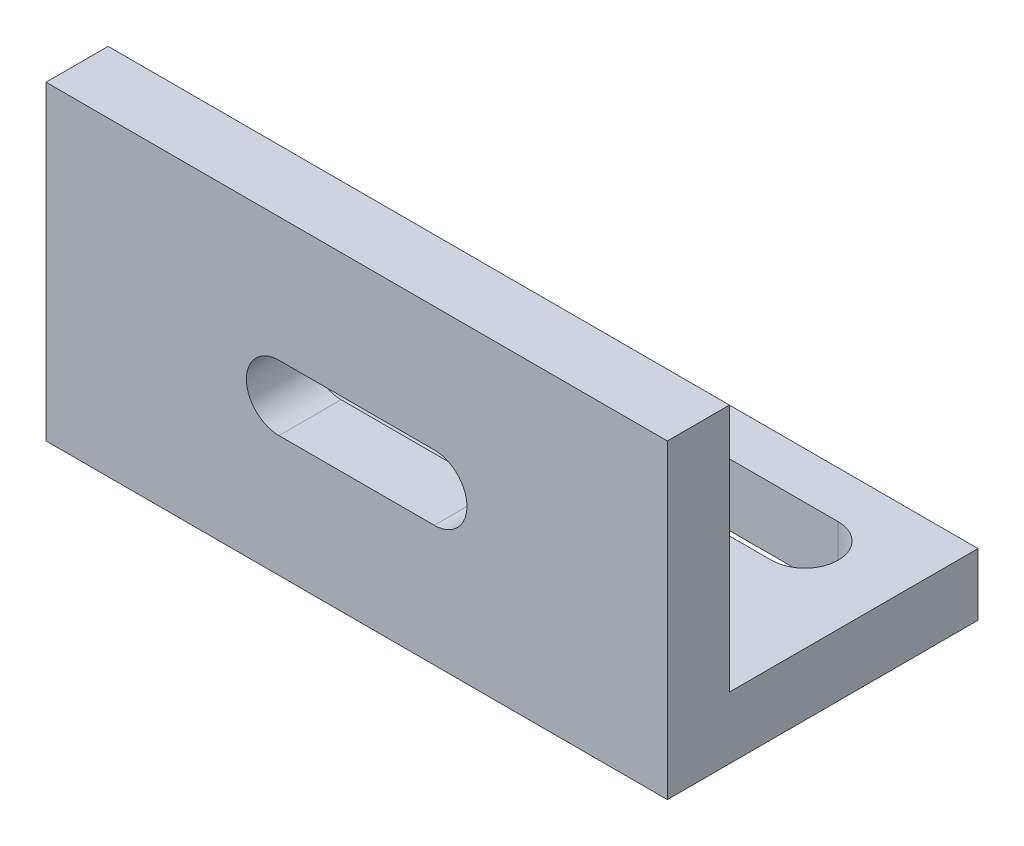
ISO-10303-21;
HEADER;
FILE_DESCRIPTION(('STEP AP214'),'2;1');
FILE_NAME('part.step','',(''),(''),'','','');
FILE_SCHEMA(('AUTOMOTIVE_DESIGN { 1 0 10303 214 1 1 1 1 }'));
ENDSEC;
DATA;
#1=APPLICATION_CONTEXT('core data for automotive mechanical design processes');
#2=APPLICATION_PROTOCOL_DEFINITION('international standard','automotive_design',2000,#1);
#3=PRODUCT_CONTEXT('',#1,'mechanical');
#4=PRODUCT('Part','Part','',(#3));
#5=PRODUCT_RELATED_PRODUCT_CATEGORY('part','',(#4));
#6=PRODUCT_DEFINITION_FORMATION('','',#4);
#7=PRODUCT_DEFINITION_CONTEXT('part definition',#1,'design');
#8=PRODUCT_DEFINITION('design','',#6,#7);
#9=PRODUCT_DEFINITION_SHAPE('','',#8);
#10=(LENGTH_UNIT() NAMED_UNIT(*) SI_UNIT(.MILLI.,.METRE.));
#11=(NAMED_UNIT(*) PLANE_ANGLE_UNIT() SI_UNIT($,.RADIAN.));
#12=(NAMED_UNIT(*) SI_UNIT($,.STERADIAN.) SOLID_ANGLE_UNIT());
#13=UNCERTAINTY_MEASURE_WITH_UNIT(LENGTH_MEASURE(1.E-05),#10,'distance_accuracy_value','');
#14=(GEOMETRIC_REPRESENTATION_CONTEXT(3) GLOBAL_UNCERTAINTY_ASSIGNED_CONTEXT((#13)) GLOBAL_UNIT_ASSIGNED_CONTEXT((#10,
#11,#12)) REPRESENTATION_CONTEXT('',''));
#15=CARTESIAN_POINT('',(0.,0.,0.));
#16=DIRECTION('',(0.,0.,1.));
#17=DIRECTION('',(1.,0.,0.));
#18=AXIS2_PLACEMENT_3D('',#15,#16,#17);
#19=CARTESIAN_POINT('',(-49.2592592592593,4.,0.));
#20=DIRECTION('',(1.,0.,0.));
#21=DIRECTION('',(0.,0.,-1.));
#22=AXIS2_PLACEMENT_3D('',#19,#20,#21);
#23=PLANE('',#22);
#24=DIRECTION('',(0.,0.,1.));
#25=VECTOR('',#24,1.);
#26=CARTESIAN_POINT('',(-49.2592592592593,0.,0.));
#27=LINE('',#26,#25);
#28=CARTESIAN_POINT('',(-49.2592592592593,0.,-12.8888888888889));
#29=VERTEX_POINT('',#28);
#30=CARTESIAN_POINT('',(-49.2592592592593,0.,7.1111111111111));
#31=VERTEX_POINT('',#30);
#32=EDGE_CURVE('E211',#29,#31,#27,.T.);
#33=ORIENTED_EDGE('',*,*,#32,.T.);
#34=DIRECTION('',(0.,-1.,0.));
#35=VECTOR('',#34,1.);
#36=CARTESIAN_POINT('',(-49.2592592592593,4.,7.1111111111111));
#37=LINE('',#36,#35);
#38=CARTESIAN_POINT('',(-49.2592592592593,20.,7.1111111111111));
#39=VERTEX_POINT('',#38);
#40=EDGE_CURVE('E237',#39,#31,#37,.T.);
#41=ORIENTED_EDGE('',*,*,#40,.F.);
#42=DIRECTION('',(0.,0.,1.));
#43=VECTOR('',#42,1.);
#44=CARTESIAN_POINT('',(-49.2592592592593,20.,7.1111111111111));
#45=LINE('',#44,#43);
#46=CARTESIAN_POINT('',(-49.2592592592593,20.,3.1111111111111));
#47=VERTEX_POINT('',#46);
#48=EDGE_CURVE('E193',#47,#39,#45,.T.);
#49=ORIENTED_EDGE('',*,*,#48,.F.);
#50=DIRECTION('',(0.,-1.,0.));
#51=VECTOR('',#50,1.);
#52=CARTESIAN_POINT('',(-49.2592592592593,20.,3.1111111111111));
#53=LINE('',#52,#51);
#54=CARTESIAN_POINT('',(-49.2592592592593,4.,3.1111111111111));
#55=VERTEX_POINT('',#54);
#56=EDGE_CURVE('E203',#47,#55,#53,.T.);
#57=ORIENTED_EDGE('',*,*,#56,.T.);
#58=DIRECTION('',(0.,0.,1.));
#59=VECTOR('',#58,1.);
#60=CARTESIAN_POINT('',(-49.2592592592593,4.,0.));
#61=LINE('',#60,#59);
#62=CARTESIAN_POINT('',(-49.2592592592593,4.,-12.8888888888889));
#63=VERTEX_POINT('',#62);
#64=EDGE_CURVE('E212',#63,#55,#61,.T.);
#65=ORIENTED_EDGE('',*,*,#64,.F.);
#66=DIRECTION('',(0.,-1.,0.));
#67=VECTOR('',#66,1.);
#68=CARTESIAN_POINT('',(-49.2592592592593,4.,-12.8888888888889));
#69=LINE('',#68,#67);
#70=EDGE_CURVE('E221',#63,#29,#69,.T.);
#71=ORIENTED_EDGE('',*,*,#70,.T.);
#72=EDGE_LOOP('',(#33,#41,#49,#57,#65,#71));
#73=FACE_BOUND('',#72,.T.);
#74=ADVANCED_FACE('F35',(#73),#23,.F.);
#75=CARTESIAN_POINT('',(0.,4.,7.1111111111111));
#76=DIRECTION('',(0.,0.,-1.));
#77=DIRECTION('',(-1.,0.,0.));
#78=AXIS2_PLACEMENT_3D('',#75,#76,#77);
#79=PLANE('',#78);
#80=DIRECTION('',(1.,0.,0.));
#81=VECTOR('',#80,1.);
#82=CARTESIAN_POINT('',(0.,11.9972184246575,7.1111111111111));
#83=LINE('',#82,#81);
#84=CARTESIAN_POINT('',(-34.2592592592593,11.9972184246575,7.1111111111111));
#85=VERTEX_POINT('',#84);
#86=CARTESIAN_POINT('',(-24.2592592592593,11.9972184246575,7.1111111111111));
#87=VERTEX_POINT('',#86);
#88=EDGE_CURVE('E166',#85,#87,#83,.T.);
#89=ORIENTED_EDGE('',*,*,#88,.T.);
#90=CARTESIAN_POINT('',(-24.2592592592593,9.89721842465749,7.1111111111111));
#91=DIRECTION('',(0.,0.,-1.));
#92=DIRECTION('',(-1.,0.,0.));
#93=AXIS2_PLACEMENT_3D('',#90,#91,#92);
#94=CIRCLE('',#93,2.1);
#95=CARTESIAN_POINT('',(-24.2592592592593,7.79721842465749,7.1111111111111));
#96=VERTEX_POINT('',#95);
#97=EDGE_CURVE('E169',#87,#96,#94,.T.);
#98=ORIENTED_EDGE('',*,*,#97,.T.);
#99=DIRECTION('',(-1.,0.,0.));
#100=VECTOR('',#99,1.);
#101=CARTESIAN_POINT('',(0.,7.79721842465749,7.1111111111111));
#102=LINE('',#101,#100);
#103=CARTESIAN_POINT('',(-34.2592592592593,7.79721842465749,7.1111111111111));
#104=VERTEX_POINT('',#103);
#105=EDGE_CURVE('E161',#96,#104,#102,.T.);
#106=ORIENTED_EDGE('',*,*,#105,.T.);
#107=CARTESIAN_POINT('',(-34.2592592592593,9.89721842465749,7.1111111111111));
#108=DIRECTION('',(0.,0.,-1.));
#109=DIRECTION('',(-1.,0.,0.));
#110=AXIS2_PLACEMENT_3D('',#107,#108,#109);
#111=CIRCLE('',#110,2.1);
#112=EDGE_CURVE('E141',#104,#85,#111,.T.);
#113=ORIENTED_EDGE('',*,*,#112,.T.);
#114=EDGE_LOOP('',(#89,#98,#106,#113));
#115=FACE_BOUND('',#114,.T.);
#116=DIRECTION('',(1.,0.,0.));
#117=VECTOR('',#116,1.);
#118=CARTESIAN_POINT('',(0.,0.,7.1111111111111));
#119=LINE('',#118,#117);
#120=CARTESIAN_POINT('',(-9.25925925925926,0.,7.1111111111111));
#121=VERTEX_POINT('',#120);
#122=EDGE_CURVE('E224',#31,#121,#119,.T.);
#123=ORIENTED_EDGE('',*,*,#122,.T.);
#124=DIRECTION('',(0.,-1.,0.));
#125=VECTOR('',#124,1.);
#126=CARTESIAN_POINT('',(-9.25925925925926,4.,7.1111111111111));
#127=LINE('',#126,#125);
#128=CARTESIAN_POINT('',(-9.25925925925926,20.,7.1111111111111));
#129=VERTEX_POINT('',#128);
#130=EDGE_CURVE('E235',#129,#121,#127,.T.);
#131=ORIENTED_EDGE('',*,*,#130,.F.);
#132=DIRECTION('',(1.,0.,0.));
#133=VECTOR('',#132,1.);
#134=CARTESIAN_POINT('',(-49.2592592592593,20.,7.1111111111111));
#135=LINE('',#134,#133);
#136=EDGE_CURVE('E196',#39,#129,#135,.T.);
#137=ORIENTED_EDGE('',*,*,#136,.F.);
#138=ORIENTED_EDGE('',*,*,#40,.T.);
#139=EDGE_LOOP('',(#123,#131,#137,#138));
#140=FACE_BOUND('',#139,.T.);
#141=ADVANCED_FACE('F280',(#115,#140),#79,.F.);
#142=CARTESIAN_POINT('',(-9.25925925925926,4.,0.));
#143=DIRECTION('',(1.,0.,0.));
#144=DIRECTION('',(0.,0.,-1.));
#145=AXIS2_PLACEMENT_3D('',#142,#143,#144);
#146=PLANE('',#145);
#147=DIRECTION('',(0.,0.,1.));
#148=VECTOR('',#147,1.);
#149=CARTESIAN_POINT('',(-9.25925925925926,0.,0.));
#150=LINE('',#149,#148);
#151=CARTESIAN_POINT('',(-9.25925925925926,0.,-12.8888888888889));
#152=VERTEX_POINT('',#151);
#153=EDGE_CURVE('E227',#152,#121,#150,.T.);
#154=ORIENTED_EDGE('',*,*,#153,.F.);
#155=DIRECTION('',(0.,-1.,0.));
#156=VECTOR('',#155,1.);
#157=CARTESIAN_POINT('',(-9.25925925925926,4.,-12.8888888888889));
#158=LINE('',#157,#156);
#159=CARTESIAN_POINT('',(-9.25925925925926,4.,-12.8888888888889));
#160=VERTEX_POINT('',#159);
#161=EDGE_CURVE('E233',#160,#152,#158,.T.);
#162=ORIENTED_EDGE('',*,*,#161,.F.);
#163=DIRECTION('',(0.,0.,1.));
#164=VECTOR('',#163,1.);
#165=CARTESIAN_POINT('',(-9.25925925925926,4.,0.));
#166=LINE('',#165,#164);
#167=CARTESIAN_POINT('',(-9.25925925925926,4.,3.1111111111111));
#168=VERTEX_POINT('',#167);
#169=EDGE_CURVE('E214',#160,#168,#166,.T.);
#170=ORIENTED_EDGE('',*,*,#169,.T.);
#171=DIRECTION('',(0.,-1.,0.));
#172=VECTOR('',#171,1.);
#173=CARTESIAN_POINT('',(-9.25925925925926,20.,3.1111111111111));
#174=LINE('',#173,#172);
#175=CARTESIAN_POINT('',(-9.25925925925926,20.,3.1111111111111));
#176=VERTEX_POINT('',#175);
#177=EDGE_CURVE('E208',#176,#168,#174,.T.);
#178=ORIENTED_EDGE('',*,*,#177,.F.);
#179=DIRECTION('',(0.,0.,-1.));
#180=VECTOR('',#179,1.);
#181=CARTESIAN_POINT('',(-9.25925925925926,20.,7.1111111111111));
#182=LINE('',#181,#180);
#183=EDGE_CURVE('E199',#129,#176,#182,.T.);
#184=ORIENTED_EDGE('',*,*,#183,.F.);
#185=ORIENTED_EDGE('',*,*,#130,.T.);
#186=EDGE_LOOP('',(#154,#162,#170,#178,#184,#185));
#187=FACE_BOUND('',#186,.T.);
#188=ADVANCED_FACE('F285',(#187),#146,.T.);
#189=CARTESIAN_POINT('',(0.,4.,-12.8888888888889));
#190=DIRECTION('',(0.,0.,-1.));
#191=DIRECTION('',(-1.,0.,0.));
#192=AXIS2_PLACEMENT_3D('',#189,#190,#191);
#193=PLANE('',#192);
#194=DIRECTION('',(1.,0.,0.));
#195=VECTOR('',#194,1.);
#196=CARTESIAN_POINT('',(0.,0.,-12.8888888888889));
#197=LINE('',#196,#195);
#198=EDGE_CURVE('E215',#29,#152,#197,.T.);
#199=ORIENTED_EDGE('',*,*,#198,.F.);
#200=ORIENTED_EDGE('',*,*,#70,.F.);
#201=DIRECTION('',(1.,0.,0.));
#202=VECTOR('',#201,1.);
#203=CARTESIAN_POINT('',(0.,4.,-12.8888888888889));
#204=LINE('',#203,#202);
#205=EDGE_CURVE('E218',#63,#160,#204,.T.);
#206=ORIENTED_EDGE('',*,*,#205,.T.);
#207=ORIENTED_EDGE('',*,*,#161,.T.);
#208=EDGE_LOOP('',(#199,#200,#206,#207));
#209=FACE_BOUND('',#208,.T.);
#210=ADVANCED_FACE('F293',(#209),#193,.T.);
#211=CARTESIAN_POINT('',(0.,4.,0.));
#212=DIRECTION('',(0.,1.,0.));
#213=DIRECTION('',(0.,0.,1.));
#214=AXIS2_PLACEMENT_3D('',#211,#212,#213);
#215=PLANE('',#214);
#216=CARTESIAN_POINT('',(-15.2592592592593,4.,-7.73888888888891));
#217=DIRECTION('',(0.,1.,0.));
#218=DIRECTION('',(0.,0.,1.));
#219=AXIS2_PLACEMENT_3D('',#216,#217,#218);
#220=CIRCLE('',#219,2.15);
#221=CARTESIAN_POINT('',(-15.2592592592593,4.,-5.58888888888891));
#222=VERTEX_POINT('',#221);
#223=CARTESIAN_POINT('',(-15.2592592592593,4.,-9.8888888888889));
#224=VERTEX_POINT('',#223);
#225=EDGE_CURVE('E172',#222,#224,#220,.T.);
#226=ORIENTED_EDGE('',*,*,#225,.F.);
#227=DIRECTION('',(1.,0.,0.));
#228=VECTOR('',#227,1.);
#229=CARTESIAN_POINT('',(-15.2592592592593,4.,-5.58888888888891));
#230=LINE('',#229,#228);
#231=CARTESIAN_POINT('',(-43.2592592592593,4.,-5.58888888888891));
#232=VERTEX_POINT('',#231);
#233=EDGE_CURVE('E180',#232,#222,#230,.T.);
#234=ORIENTED_EDGE('',*,*,#233,.F.);
#235=CARTESIAN_POINT('',(-43.2592592592593,4.,-7.73888888888891));
#236=DIRECTION('',(0.,1.,0.));
#237=DIRECTION('',(0.,0.,1.));
#238=AXIS2_PLACEMENT_3D('',#235,#236,#237);
#239=CIRCLE('',#238,2.14999999999999);
#240=CARTESIAN_POINT('',(-43.2592592592593,4.,-9.8888888888889));
#241=VERTEX_POINT('',#240);
#242=EDGE_CURVE('E177',#241,#232,#239,.T.);
#243=ORIENTED_EDGE('',*,*,#242,.F.);
#244=DIRECTION('',(-1.,0.,0.));
#245=VECTOR('',#244,1.);
#246=CARTESIAN_POINT('',(-15.2592592592593,4.,-9.8888888888889));
#247=LINE('',#246,#245);
#248=EDGE_CURVE('E174',#224,#241,#247,.T.);
#249=ORIENTED_EDGE('',*,*,#248,.F.);
#250=EDGE_LOOP('',(#226,#234,#243,#249));
#251=FACE_BOUND('',#250,.T.);
#252=DIRECTION('',(-1.,0.,0.));
#253=VECTOR('',#252,1.);
#254=CARTESIAN_POINT('',(-49.2592592592593,4.,3.1111111111111));
#255=LINE('',#254,#253);
#256=EDGE_CURVE('E186',#168,#55,#255,.T.);
#257=ORIENTED_EDGE('',*,*,#256,.F.);
#258=ORIENTED_EDGE('',*,*,#169,.F.);
#259=ORIENTED_EDGE('',*,*,#205,.F.);
#260=ORIENTED_EDGE('',*,*,#64,.T.);
#261=EDGE_LOOP('',(#257,#258,#259,#260));
#262=FACE_BOUND('',#261,.T.);
#263=ADVANCED_FACE('F261',(#251,#262),#215,.T.);
#264=CARTESIAN_POINT('',(0.,0.,0.));
#265=DIRECTION('',(0.,1.,0.));
#266=DIRECTION('',(0.,0.,1.));
#267=AXIS2_PLACEMENT_3D('',#264,#265,#266);
#268=PLANE('',#267);
#269=DIRECTION('',(1.,0.,0.));
#270=VECTOR('',#269,1.);
#271=CARTESIAN_POINT('',(0.,0.,-5.58888888888891));
#272=LINE('',#271,#270);
#273=CARTESIAN_POINT('',(-43.2592592592593,0.,-5.58888888888891));
#274=VERTEX_POINT('',#273);
#275=CARTESIAN_POINT('',(-15.2592592592593,0.,-5.58888888888891));
#276=VERTEX_POINT('',#275);
#277=EDGE_CURVE('E42',#274,#276,#272,.T.);
#278=ORIENTED_EDGE('',*,*,#277,.T.);
#279=CARTESIAN_POINT('',(-15.2592592592593,0.,-7.73888888888891));
#280=DIRECTION('',(0.,1.,0.));
#281=DIRECTION('',(0.,0.,1.));
#282=AXIS2_PLACEMENT_3D('',#279,#280,#281);
#283=CIRCLE('',#282,2.15);
#284=CARTESIAN_POINT('',(-15.2592592592593,0.,-9.8888888888889));
#285=VERTEX_POINT('',#284);
#286=EDGE_CURVE('E11',#276,#285,#283,.T.);
#287=ORIENTED_EDGE('',*,*,#286,.T.);
#288=DIRECTION('',(-1.,0.,0.));
#289=VECTOR('',#288,1.);
#290=CARTESIAN_POINT('',(0.,0.,-9.88888888888891));
#291=LINE('',#290,#289);
#292=CARTESIAN_POINT('',(-43.2592592592593,0.,-9.8888888888889));
#293=VERTEX_POINT('',#292);
#294=EDGE_CURVE('E240',#285,#293,#291,.T.);
#295=ORIENTED_EDGE('',*,*,#294,.T.);
#296=CARTESIAN_POINT('',(-43.2592592592593,0.,-7.73888888888891));
#297=DIRECTION('',(0.,1.,0.));
#298=DIRECTION('',(0.,0.,1.));
#299=AXIS2_PLACEMENT_3D('',#296,#297,#298);
#300=CIRCLE('',#299,2.14999999999999);
#301=EDGE_CURVE('E243',#293,#274,#300,.T.);
#302=ORIENTED_EDGE('',*,*,#301,.T.);
#303=EDGE_LOOP('',(#278,#287,#295,#302));
#304=FACE_BOUND('',#303,.T.);
#305=ORIENTED_EDGE('',*,*,#32,.F.);
#306=ORIENTED_EDGE('',*,*,#198,.T.);
#307=ORIENTED_EDGE('',*,*,#153,.T.);
#308=ORIENTED_EDGE('',*,*,#122,.F.);
#309=EDGE_LOOP('',(#305,#306,#307,#308));
#310=FACE_BOUND('',#309,.T.);
#311=ADVANCED_FACE('F247',(#304,#310),#268,.F.);
#312=CARTESIAN_POINT('',(-49.2592592592593,20.,3.1111111111111));
#313=DIRECTION('',(0.,0.,1.));
#314=DIRECTION('',(1.,0.,0.));
#315=AXIS2_PLACEMENT_3D('',#312,#313,#314);
#316=PLANE('',#315);
#317=DIRECTION('',(-1.,0.,0.));
#318=VECTOR('',#317,1.);
#319=CARTESIAN_POINT('',(-24.2592592592593,7.79721842465749,3.1111111111111));
#320=LINE('',#319,#318);
#321=CARTESIAN_POINT('',(-24.2592592592593,7.79721842465749,3.1111111111111));
#322=VERTEX_POINT('',#321);
#323=CARTESIAN_POINT('',(-34.2592592592593,7.79721842465749,3.1111111111111));
#324=VERTEX_POINT('',#323);
#325=EDGE_CURVE('E147',#322,#324,#320,.T.);
#326=ORIENTED_EDGE('',*,*,#325,.F.);
#327=CARTESIAN_POINT('',(-24.2592592592593,9.89721842465749,3.1111111111111));
#328=DIRECTION('',(0.,0.,-1.));
#329=DIRECTION('',(-1.,0.,0.));
#330=AXIS2_PLACEMENT_3D('',#327,#328,#329);
#331=CIRCLE('',#330,2.1);
#332=CARTESIAN_POINT('',(-24.2592592592593,11.9972184246575,3.1111111111111));
#333=VERTEX_POINT('',#332);
#334=EDGE_CURVE('E57',#333,#322,#331,.T.);
#335=ORIENTED_EDGE('',*,*,#334,.F.);
#336=DIRECTION('',(1.,0.,0.));
#337=VECTOR('',#336,1.);
#338=CARTESIAN_POINT('',(-24.2592592592593,11.9972184246575,3.1111111111111));
#339=LINE('',#338,#337);
#340=CARTESIAN_POINT('',(-34.2592592592593,11.9972184246575,3.1111111111111));
#341=VERTEX_POINT('',#340);
#342=EDGE_CURVE('E154',#341,#333,#339,.T.);
#343=ORIENTED_EDGE('',*,*,#342,.F.);
#344=CARTESIAN_POINT('',(-34.2592592592593,9.89721842465749,3.1111111111111));
#345=DIRECTION('',(0.,0.,-1.));
#346=DIRECTION('',(-1.,0.,0.));
#347=AXIS2_PLACEMENT_3D('',#344,#345,#346);
#348=CIRCLE('',#347,2.1);
#349=EDGE_CURVE('E138',#324,#341,#348,.T.);
#350=ORIENTED_EDGE('',*,*,#349,.F.);
#351=EDGE_LOOP('',(#326,#335,#343,#350));
#352=FACE_BOUND('',#351,.T.);
#353=ORIENTED_EDGE('',*,*,#256,.T.);
#354=ORIENTED_EDGE('',*,*,#56,.F.);
#355=DIRECTION('',(-1.,0.,0.));
#356=VECTOR('',#355,1.);
#357=CARTESIAN_POINT('',(-49.2592592592593,20.,3.1111111111111));
#358=LINE('',#357,#356);
#359=EDGE_CURVE('E201',#176,#47,#358,.T.);
#360=ORIENTED_EDGE('',*,*,#359,.F.);
#361=ORIENTED_EDGE('',*,*,#177,.T.);
#362=EDGE_LOOP('',(#353,#354,#360,#361));
#363=FACE_BOUND('',#362,.T.);
#364=ADVANCED_FACE('F151',(#352,#363),#316,.F.);
#365=CARTESIAN_POINT('',(0.,20.,0.));
#366=DIRECTION('',(0.,-1.,0.));
#367=DIRECTION('',(0.,0.,-1.));
#368=AXIS2_PLACEMENT_3D('',#365,#366,#367);
#369=PLANE('',#368);
#370=ORIENTED_EDGE('',*,*,#48,.T.);
#371=ORIENTED_EDGE('',*,*,#136,.T.);
#372=ORIENTED_EDGE('',*,*,#183,.T.);
#373=ORIENTED_EDGE('',*,*,#359,.T.);
#374=EDGE_LOOP('',(#370,#371,#372,#373));
#375=FACE_BOUND('',#374,.T.);
#376=ADVANCED_FACE('F302',(#375),#369,.F.);
#377=CARTESIAN_POINT('',(-15.2592592592593,-6.,-7.73888888888891));
#378=DIRECTION('',(0.,1.,0.));
#379=DIRECTION('',(0.,0.,1.));
#380=AXIS2_PLACEMENT_3D('',#377,#378,#379);
#381=CYLINDRICAL_SURFACE('',#380,2.15);
#382=DIRECTION('',(0.,1.,0.));
#383=VECTOR('',#382,1.);
#384=CARTESIAN_POINT('',(-15.2592592592593,-6.,-5.58888888888891));
#385=LINE('',#384,#383);
#386=EDGE_CURVE('E184',#276,#222,#385,.T.);
#387=ORIENTED_EDGE('',*,*,#386,.T.);
#388=ORIENTED_EDGE('',*,*,#225,.T.);
#389=DIRECTION('',(0.,1.,0.));
#390=VECTOR('',#389,1.);
#391=CARTESIAN_POINT('',(-15.2592592592593,-6.,-9.8888888888889));
#392=LINE('',#391,#390);
#393=EDGE_CURVE('E183',#285,#224,#392,.T.);
#394=ORIENTED_EDGE('',*,*,#393,.F.);
#395=ORIENTED_EDGE('',*,*,#286,.F.);
#396=EDGE_LOOP('',(#387,#388,#394,#395));
#397=FACE_BOUND('',#396,.T.);
#398=ADVANCED_FACE('F265',(#397),#381,.F.);
#399=CARTESIAN_POINT('',(-15.2592592592593,-6.,-5.58888888888891));
#400=DIRECTION('',(0.,0.,1.));
#401=DIRECTION('',(1.,0.,0.));
#402=AXIS2_PLACEMENT_3D('',#399,#400,#401);
#403=PLANE('',#402);
#404=DIRECTION('',(0.,1.,0.));
#405=VECTOR('',#404,1.);
#406=CARTESIAN_POINT('',(-43.2592592592593,-6.,-5.58888888888891));
#407=LINE('',#406,#405);
#408=EDGE_CURVE('E187',#274,#232,#407,.T.);
#409=ORIENTED_EDGE('',*,*,#408,.T.);
#410=ORIENTED_EDGE('',*,*,#233,.T.);
#411=ORIENTED_EDGE('',*,*,#386,.F.);
#412=ORIENTED_EDGE('',*,*,#277,.F.);
#413=EDGE_LOOP('',(#409,#410,#411,#412));
#414=FACE_BOUND('',#413,.T.);
#415=ADVANCED_FACE('F253',(#414),#403,.F.);
#416=CARTESIAN_POINT('',(-43.2592592592593,-6.,-7.73888888888891));
#417=DIRECTION('',(0.,1.,0.));
#418=DIRECTION('',(0.,0.,1.));
#419=AXIS2_PLACEMENT_3D('',#416,#417,#418);
#420=CYLINDRICAL_SURFACE('',#419,2.14999999999999);
#421=DIRECTION('',(0.,1.,0.));
#422=VECTOR('',#421,1.);
#423=CARTESIAN_POINT('',(-43.2592592592593,-6.,-9.8888888888889));
#424=LINE('',#423,#422);
#425=EDGE_CURVE('E189',#293,#241,#424,.T.);
#426=ORIENTED_EDGE('',*,*,#425,.T.);
#427=ORIENTED_EDGE('',*,*,#242,.T.);
#428=ORIENTED_EDGE('',*,*,#408,.F.);
#429=ORIENTED_EDGE('',*,*,#301,.F.);
#430=EDGE_LOOP('',(#426,#427,#428,#429));
#431=FACE_BOUND('',#430,.T.);
#432=ADVANCED_FACE('F255',(#431),#420,.F.);
#433=CARTESIAN_POINT('',(-15.2592592592593,-6.,-9.8888888888889));
#434=DIRECTION('',(0.,0.,-1.));
#435=DIRECTION('',(-1.,0.,0.));
#436=AXIS2_PLACEMENT_3D('',#433,#434,#435);
#437=PLANE('',#436);
#438=ORIENTED_EDGE('',*,*,#393,.T.);
#439=ORIENTED_EDGE('',*,*,#248,.T.);
#440=ORIENTED_EDGE('',*,*,#425,.F.);
#441=ORIENTED_EDGE('',*,*,#294,.F.);
#442=EDGE_LOOP('',(#438,#439,#440,#441));
#443=FACE_BOUND('',#442,.T.);
#444=ADVANCED_FACE('F267',(#443),#437,.F.);
#445=CARTESIAN_POINT('',(-24.2592592592593,9.89721842465749,13.1111111111111));
#446=DIRECTION('',(0.,0.,-1.));
#447=DIRECTION('',(-1.,0.,0.));
#448=AXIS2_PLACEMENT_3D('',#445,#446,#447);
#449=CYLINDRICAL_SURFACE('',#448,2.1);
#450=DIRECTION('',(0.,0.,-1.));
#451=VECTOR('',#450,1.);
#452=CARTESIAN_POINT('',(-24.2592592592593,11.9972184246575,13.1111111111111));
#453=LINE('',#452,#451);
#454=EDGE_CURVE('E159',#87,#333,#453,.T.);
#455=ORIENTED_EDGE('',*,*,#454,.T.);
#456=ORIENTED_EDGE('',*,*,#334,.T.);
#457=DIRECTION('',(0.,0.,-1.));
#458=VECTOR('',#457,1.);
#459=CARTESIAN_POINT('',(-24.2592592592593,7.79721842465749,13.1111111111111));
#460=LINE('',#459,#458);
#461=EDGE_CURVE('E144',#96,#322,#460,.T.);
#462=ORIENTED_EDGE('',*,*,#461,.F.);
#463=ORIENTED_EDGE('',*,*,#97,.F.);
#464=EDGE_LOOP('',(#455,#456,#462,#463));
#465=FACE_BOUND('',#464,.T.);
#466=ADVANCED_FACE('F269',(#465),#449,.F.);
#467=CARTESIAN_POINT('',(-24.2592592592593,11.9972184246575,13.1111111111111));
#468=DIRECTION('',(0.,1.,0.));
#469=DIRECTION('',(0.,0.,1.));
#470=AXIS2_PLACEMENT_3D('',#467,#468,#469);
#471=PLANE('',#470);
#472=DIRECTION('',(0.,0.,-1.));
#473=VECTOR('',#472,1.);
#474=CARTESIAN_POINT('',(-34.2592592592593,11.9972184246575,13.1111111111111));
#475=LINE('',#474,#473);
#476=EDGE_CURVE('E143',#85,#341,#475,.T.);
#477=ORIENTED_EDGE('',*,*,#476,.T.);
#478=ORIENTED_EDGE('',*,*,#342,.T.);
#479=ORIENTED_EDGE('',*,*,#454,.F.);
#480=ORIENTED_EDGE('',*,*,#88,.F.);
#481=EDGE_LOOP('',(#477,#478,#479,#480));
#482=FACE_BOUND('',#481,.T.);
#483=ADVANCED_FACE('F275',(#482),#471,.F.);
#484=CARTESIAN_POINT('',(-34.2592592592593,9.89721842465749,13.1111111111111));
#485=DIRECTION('',(0.,0.,-1.));
#486=DIRECTION('',(-1.,0.,0.));
#487=AXIS2_PLACEMENT_3D('',#484,#485,#486);
#488=CYLINDRICAL_SURFACE('',#487,2.1);
#489=DIRECTION('',(0.,0.,-1.));
#490=VECTOR('',#489,1.);
#491=CARTESIAN_POINT('',(-34.2592592592593,7.79721842465749,13.1111111111111));
#492=LINE('',#491,#490);
#493=EDGE_CURVE('E49',#104,#324,#492,.T.);
#494=ORIENTED_EDGE('',*,*,#493,.T.);
#495=ORIENTED_EDGE('',*,*,#349,.T.);
#496=ORIENTED_EDGE('',*,*,#476,.F.);
#497=ORIENTED_EDGE('',*,*,#112,.F.);
#498=EDGE_LOOP('',(#494,#495,#496,#497));
#499=FACE_BOUND('',#498,.T.);
#500=ADVANCED_FACE('F135',(#499),#488,.F.);
#501=CARTESIAN_POINT('',(-24.2592592592593,7.79721842465749,13.1111111111111));
#502=DIRECTION('',(0.,-1.,0.));
#503=DIRECTION('',(0.,0.,-1.));
#504=AXIS2_PLACEMENT_3D('',#501,#502,#503);
#505=PLANE('',#504);
#506=ORIENTED_EDGE('',*,*,#461,.T.);
#507=ORIENTED_EDGE('',*,*,#325,.T.);
#508=ORIENTED_EDGE('',*,*,#493,.F.);
#509=ORIENTED_EDGE('',*,*,#105,.F.);
#510=EDGE_LOOP('',(#506,#507,#508,#509));
#511=FACE_BOUND('',#510,.T.);
#512=ADVANCED_FACE('F148',(#511),#505,.F.);
#513=CLOSED_SHELL('',(#74,#141,#188,#210,#263,#311,#364,#376,#398,#415,#432,#444,#466,#483,#500,#512));
#514=MANIFOLD_SOLID_BREP('B2',#513);
#515=ADVANCED_BREP_SHAPE_REPRESENTATION('',(#18,#514),#14);
#516=SHAPE_DEFINITION_REPRESENTATION(#9,#515);
ENDSEC;
END-ISO-10303-21;
